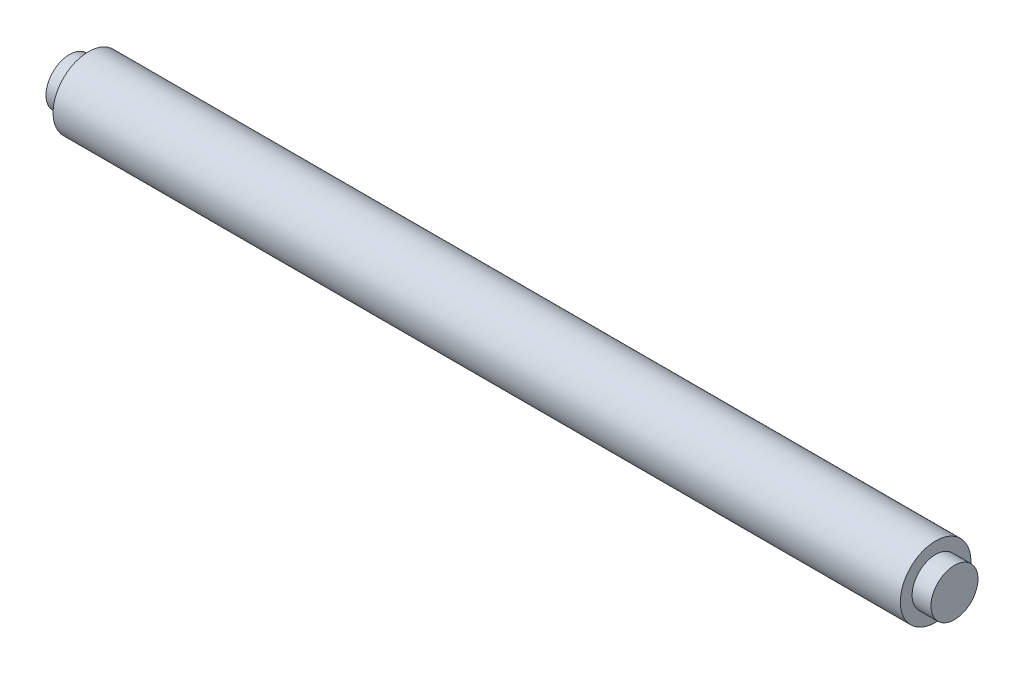
ISO-10303-21;
HEADER;
FILE_DESCRIPTION(('STEP AP214'),'2;1');
FILE_NAME('part.step','',(''),(''),'','','');
FILE_SCHEMA(('AUTOMOTIVE_DESIGN { 1 0 10303 214 1 1 1 1 }'));
ENDSEC;
DATA;
#1=APPLICATION_CONTEXT('core data for automotive mechanical design processes');
#2=APPLICATION_PROTOCOL_DEFINITION('international standard','automotive_design',2000,#1);
#3=PRODUCT_CONTEXT('',#1,'mechanical');
#4=PRODUCT('Part','Part','',(#3));
#5=PRODUCT_RELATED_PRODUCT_CATEGORY('part','',(#4));
#6=PRODUCT_DEFINITION_FORMATION('','',#4);
#7=PRODUCT_DEFINITION_CONTEXT('part definition',#1,'design');
#8=PRODUCT_DEFINITION('design','',#6,#7);
#9=PRODUCT_DEFINITION_SHAPE('','',#8);
#10=(LENGTH_UNIT() NAMED_UNIT(*) SI_UNIT(.MILLI.,.METRE.));
#11=(NAMED_UNIT(*) PLANE_ANGLE_UNIT() SI_UNIT($,.RADIAN.));
#12=(NAMED_UNIT(*) SI_UNIT($,.STERADIAN.) SOLID_ANGLE_UNIT());
#13=UNCERTAINTY_MEASURE_WITH_UNIT(LENGTH_MEASURE(1.E-05),#10,'distance_accuracy_value','');
#14=(GEOMETRIC_REPRESENTATION_CONTEXT(3) GLOBAL_UNCERTAINTY_ASSIGNED_CONTEXT((#13)) GLOBAL_UNIT_ASSIGNED_CONTEXT((#10,
#11,#12)) REPRESENTATION_CONTEXT('',''));
#15=CARTESIAN_POINT('',(0.,0.,0.));
#16=DIRECTION('',(0.,0.,1.));
#17=DIRECTION('',(1.,0.,0.));
#18=AXIS2_PLACEMENT_3D('',#15,#16,#17);
#19=CARTESIAN_POINT('',(18.,0.,0.));
#20=DIRECTION('',(-1.,0.,0.));
#21=DIRECTION('',(0.,0.,1.));
#22=AXIS2_PLACEMENT_3D('',#19,#20,#21);
#23=CYLINDRICAL_SURFACE('',#22,0.75);
#24=CARTESIAN_POINT('',(18.,0.,0.));
#25=DIRECTION('',(1.,0.,0.));
#26=DIRECTION('',(0.,0.,-1.));
#27=AXIS2_PLACEMENT_3D('',#24,#25,#26);
#28=CIRCLE('',#27,0.75);
#29=CARTESIAN_POINT('',(18.,0.,-0.75));
#30=VERTEX_POINT('',#29);
#31=EDGE_CURVE('E55',#30,#30,#28,.T.);
#32=ORIENTED_EDGE('',*,*,#31,.F.);
#33=EDGE_LOOP('',(#32));
#34=FACE_BOUND('',#33,.T.);
#35=CARTESIAN_POINT('',(0.,0.,0.));
#36=DIRECTION('',(1.,0.,0.));
#37=DIRECTION('',(0.,0.,-1.));
#38=AXIS2_PLACEMENT_3D('',#35,#36,#37);
#39=CIRCLE('',#38,0.75);
#40=CARTESIAN_POINT('',(0.,0.,-0.75));
#41=VERTEX_POINT('',#40);
#42=EDGE_CURVE('E44',#41,#41,#39,.T.);
#43=ORIENTED_EDGE('',*,*,#42,.T.);
#44=EDGE_LOOP('',(#43));
#45=FACE_BOUND('',#44,.T.);
#46=ADVANCED_FACE('F41',(#34,#45),#23,.T.);
#47=CARTESIAN_POINT('',(18.,0.,0.));
#48=DIRECTION('',(1.,0.,0.));
#49=DIRECTION('',(0.,0.,-1.));
#50=AXIS2_PLACEMENT_3D('',#47,#48,#49);
#51=PLANE('',#50);
#52=CARTESIAN_POINT('',(18.,0.,0.));
#53=DIRECTION('',(1.,0.,0.));
#54=DIRECTION('',(0.,0.,-1.));
#55=AXIS2_PLACEMENT_3D('',#52,#53,#54);
#56=CIRCLE('',#55,0.5);
#57=CARTESIAN_POINT('',(18.,0.,-0.5));
#58=VERTEX_POINT('',#57);
#59=EDGE_CURVE('E49',#58,#58,#56,.T.);
#60=ORIENTED_EDGE('',*,*,#59,.F.);
#61=EDGE_LOOP('',(#60));
#62=FACE_BOUND('',#61,.T.);
#63=ORIENTED_EDGE('',*,*,#31,.T.);
#64=EDGE_LOOP('',(#63));
#65=FACE_BOUND('',#64,.T.);
#66=ADVANCED_FACE('F75',(#62,#65),#51,.T.);
#67=CARTESIAN_POINT('',(0.,0.,0.));
#68=DIRECTION('',(1.,0.,0.));
#69=DIRECTION('',(0.,0.,-1.));
#70=AXIS2_PLACEMENT_3D('',#67,#68,#69);
#71=PLANE('',#70);
#72=CARTESIAN_POINT('',(0.,0.,0.));
#73=DIRECTION('',(-1.,0.,0.));
#74=DIRECTION('',(0.,0.,1.));
#75=AXIS2_PLACEMENT_3D('',#72,#73,#74);
#76=CIRCLE('',#75,0.5);
#77=CARTESIAN_POINT('',(0.,0.,0.5));
#78=VERTEX_POINT('',#77);
#79=EDGE_CURVE('E10',#78,#78,#76,.T.);
#80=ORIENTED_EDGE('',*,*,#79,.F.);
#81=EDGE_LOOP('',(#80));
#82=FACE_BOUND('',#81,.T.);
#83=ORIENTED_EDGE('',*,*,#42,.F.);
#84=EDGE_LOOP('',(#83));
#85=FACE_BOUND('',#84,.T.);
#86=ADVANCED_FACE('F72',(#82,#85),#71,.F.);
#87=CARTESIAN_POINT('',(18.4,0.,0.));
#88=DIRECTION('',(-1.,0.,0.));
#89=DIRECTION('',(0.,0.,1.));
#90=AXIS2_PLACEMENT_3D('',#87,#88,#89);
#91=CYLINDRICAL_SURFACE('',#90,0.5);
#92=CARTESIAN_POINT('',(18.4,0.,0.));
#93=DIRECTION('',(1.,0.,0.));
#94=DIRECTION('',(0.,0.,-1.));
#95=AXIS2_PLACEMENT_3D('',#92,#93,#94);
#96=CIRCLE('',#95,0.5);
#97=CARTESIAN_POINT('',(18.4,0.,-0.5));
#98=VERTEX_POINT('',#97);
#99=EDGE_CURVE('E60',#98,#98,#96,.T.);
#100=ORIENTED_EDGE('',*,*,#99,.F.);
#101=EDGE_LOOP('',(#100));
#102=FACE_BOUND('',#101,.T.);
#103=ORIENTED_EDGE('',*,*,#59,.T.);
#104=EDGE_LOOP('',(#103));
#105=FACE_BOUND('',#104,.T.);
#106=ADVANCED_FACE('F74',(#102,#105),#91,.T.);
#107=CARTESIAN_POINT('',(18.4,0.,0.));
#108=DIRECTION('',(1.,0.,0.));
#109=DIRECTION('',(0.,0.,-1.));
#110=AXIS2_PLACEMENT_3D('',#107,#108,#109);
#111=PLANE('',#110);
#112=ORIENTED_EDGE('',*,*,#99,.T.);
#113=EDGE_LOOP('',(#112));
#114=FACE_BOUND('',#113,.T.);
#115=ADVANCED_FACE('F81',(#114),#111,.T.);
#116=CARTESIAN_POINT('',(-0.4,0.,0.));
#117=DIRECTION('',(1.,0.,0.));
#118=DIRECTION('',(0.,0.,-1.));
#119=AXIS2_PLACEMENT_3D('',#116,#117,#118);
#120=CYLINDRICAL_SURFACE('',#119,0.5);
#121=CARTESIAN_POINT('',(-0.4,0.,0.));
#122=DIRECTION('',(-1.,0.,0.));
#123=DIRECTION('',(0.,0.,1.));
#124=AXIS2_PLACEMENT_3D('',#121,#122,#123);
#125=CIRCLE('',#124,0.5);
#126=CARTESIAN_POINT('',(-0.4,0.,0.5));
#127=VERTEX_POINT('',#126);
#128=EDGE_CURVE('E59',#127,#127,#125,.T.);
#129=ORIENTED_EDGE('',*,*,#128,.F.);
#130=EDGE_LOOP('',(#129));
#131=FACE_BOUND('',#130,.T.);
#132=ORIENTED_EDGE('',*,*,#79,.T.);
#133=EDGE_LOOP('',(#132));
#134=FACE_BOUND('',#133,.T.);
#135=ADVANCED_FACE('F111',(#131,#134),#120,.T.);
#136=CARTESIAN_POINT('',(-0.4,0.,0.));
#137=DIRECTION('',(-1.,0.,0.));
#138=DIRECTION('',(0.,0.,1.));
#139=AXIS2_PLACEMENT_3D('',#136,#137,#138);
#140=PLANE('',#139);
#141=ORIENTED_EDGE('',*,*,#128,.T.);
#142=EDGE_LOOP('',(#141));
#143=FACE_BOUND('',#142,.T.);
#144=ADVANCED_FACE('F127',(#143),#140,.T.);
#145=CLOSED_SHELL('',(#46,#66,#86,#106,#115,#135,#144));
#146=MANIFOLD_SOLID_BREP('B2',#145);
#147=ADVANCED_BREP_SHAPE_REPRESENTATION('',(#18,#146),#14);
#148=SHAPE_DEFINITION_REPRESENTATION(#9,#147);
ENDSEC;
END-ISO-10303-21;
